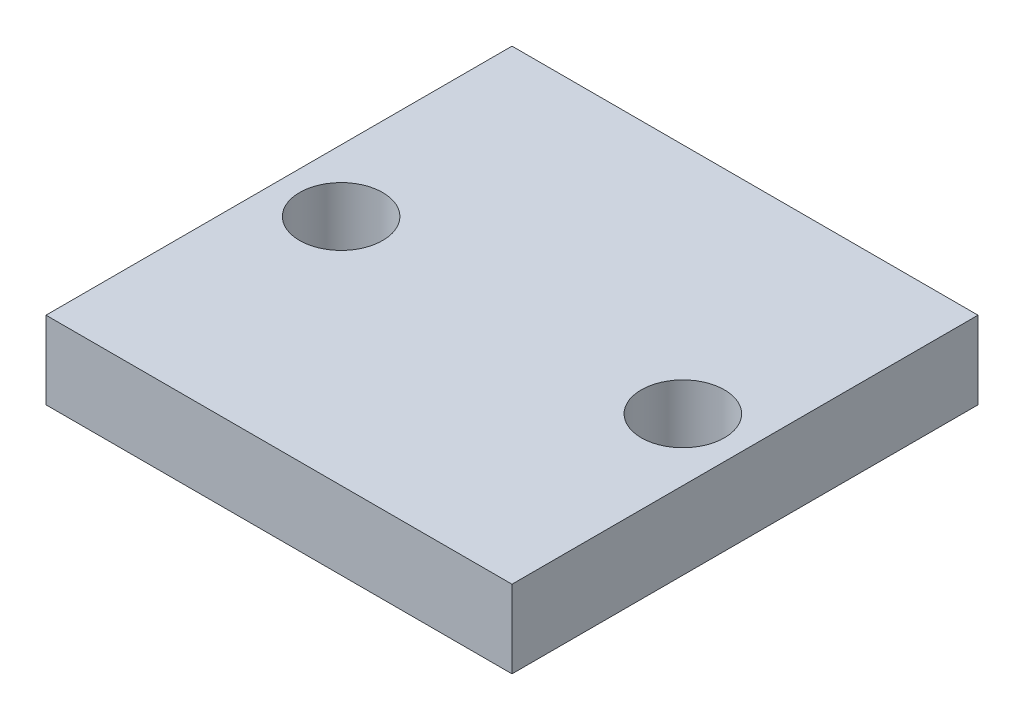
ISO-10303-21;
HEADER;
FILE_DESCRIPTION(('STEP AP214'),'2;1');
FILE_NAME('part.step','',(''),(''),'','','');
FILE_SCHEMA(('AUTOMOTIVE_DESIGN { 1 0 10303 214 1 1 1 1 }'));
ENDSEC;
DATA;
#1=APPLICATION_CONTEXT('core data for automotive mechanical design processes');
#2=APPLICATION_PROTOCOL_DEFINITION('international standard','automotive_design',2000,#1);
#3=PRODUCT_CONTEXT('',#1,'mechanical');
#4=PRODUCT('Part','Part','',(#3));
#5=PRODUCT_RELATED_PRODUCT_CATEGORY('part','',(#4));
#6=PRODUCT_DEFINITION_FORMATION('','',#4);
#7=PRODUCT_DEFINITION_CONTEXT('part definition',#1,'design');
#8=PRODUCT_DEFINITION('design','',#6,#7);
#9=PRODUCT_DEFINITION_SHAPE('','',#8);
#10=(LENGTH_UNIT() NAMED_UNIT(*) SI_UNIT(.MILLI.,.METRE.));
#11=(NAMED_UNIT(*) PLANE_ANGLE_UNIT() SI_UNIT($,.RADIAN.));
#12=(NAMED_UNIT(*) SI_UNIT($,.STERADIAN.) SOLID_ANGLE_UNIT());
#13=UNCERTAINTY_MEASURE_WITH_UNIT(LENGTH_MEASURE(1.E-05),#10,'distance_accuracy_value','');
#14=(GEOMETRIC_REPRESENTATION_CONTEXT(3) GLOBAL_UNCERTAINTY_ASSIGNED_CONTEXT((#13)) GLOBAL_UNIT_ASSIGNED_CONTEXT((#10,
#11,#12)) REPRESENTATION_CONTEXT('',''));
#15=CARTESIAN_POINT('',(0.,0.,0.));
#16=DIRECTION('',(0.,0.,1.));
#17=DIRECTION('',(1.,0.,0.));
#18=AXIS2_PLACEMENT_3D('',#15,#16,#17);
#19=CARTESIAN_POINT('',(-9.525,3.175,9.525));
#20=DIRECTION('',(1.,0.,0.));
#21=DIRECTION('',(0.,0.,-1.));
#22=AXIS2_PLACEMENT_3D('',#19,#20,#21);
#23=PLANE('',#22);
#24=DIRECTION('',(0.,0.,1.));
#25=VECTOR('',#24,1.);
#26=CARTESIAN_POINT('',(-9.525,0.,9.525));
#27=LINE('',#26,#25);
#28=CARTESIAN_POINT('',(-9.525,0.,-9.525));
#29=VERTEX_POINT('',#28);
#30=CARTESIAN_POINT('',(-9.525,0.,9.525));
#31=VERTEX_POINT('',#30);
#32=EDGE_CURVE('E95',#29,#31,#27,.T.);
#33=ORIENTED_EDGE('',*,*,#32,.T.);
#34=DIRECTION('',(0.,-1.,0.));
#35=VECTOR('',#34,1.);
#36=CARTESIAN_POINT('',(-9.525,3.175,9.525));
#37=LINE('',#36,#35);
#38=CARTESIAN_POINT('',(-9.525,3.175,9.525));
#39=VERTEX_POINT('',#38);
#40=EDGE_CURVE('E11',#39,#31,#37,.T.);
#41=ORIENTED_EDGE('',*,*,#40,.F.);
#42=DIRECTION('',(0.,0.,1.));
#43=VECTOR('',#42,1.);
#44=CARTESIAN_POINT('',(-9.525,3.175,9.525));
#45=LINE('',#44,#43);
#46=CARTESIAN_POINT('',(-9.525,3.175,-9.525));
#47=VERTEX_POINT('',#46);
#48=EDGE_CURVE('E83',#47,#39,#45,.T.);
#49=ORIENTED_EDGE('',*,*,#48,.F.);
#50=DIRECTION('',(0.,-1.,0.));
#51=VECTOR('',#50,1.);
#52=CARTESIAN_POINT('',(-9.525,3.175,-9.525));
#53=LINE('',#52,#51);
#54=EDGE_CURVE('E91',#47,#29,#53,.T.);
#55=ORIENTED_EDGE('',*,*,#54,.T.);
#56=EDGE_LOOP('',(#33,#41,#49,#55));
#57=FACE_BOUND('',#56,.T.);
#58=ADVANCED_FACE('F32',(#57),#23,.F.);
#59=CARTESIAN_POINT('',(9.525,3.175,9.525));
#60=DIRECTION('',(0.,0.,-1.));
#61=DIRECTION('',(-1.,0.,0.));
#62=AXIS2_PLACEMENT_3D('',#59,#60,#61);
#63=PLANE('',#62);
#64=DIRECTION('',(1.,0.,0.));
#65=VECTOR('',#64,1.);
#66=CARTESIAN_POINT('',(9.525,0.,9.525));
#67=LINE('',#66,#65);
#68=CARTESIAN_POINT('',(9.525,0.,9.525));
#69=VERTEX_POINT('',#68);
#70=EDGE_CURVE('E87',#31,#69,#67,.T.);
#71=ORIENTED_EDGE('',*,*,#70,.T.);
#72=DIRECTION('',(0.,-1.,0.));
#73=VECTOR('',#72,1.);
#74=CARTESIAN_POINT('',(9.525,3.175,9.525));
#75=LINE('',#74,#73);
#76=CARTESIAN_POINT('',(9.525,3.175,9.525));
#77=VERTEX_POINT('',#76);
#78=EDGE_CURVE('E40',#77,#69,#75,.T.);
#79=ORIENTED_EDGE('',*,*,#78,.F.);
#80=DIRECTION('',(1.,0.,0.));
#81=VECTOR('',#80,1.);
#82=CARTESIAN_POINT('',(9.525,3.175,9.525));
#83=LINE('',#82,#81);
#84=EDGE_CURVE('E78',#39,#77,#83,.T.);
#85=ORIENTED_EDGE('',*,*,#84,.F.);
#86=ORIENTED_EDGE('',*,*,#40,.T.);
#87=EDGE_LOOP('',(#71,#79,#85,#86));
#88=FACE_BOUND('',#87,.T.);
#89=ADVANCED_FACE('F86',(#88),#63,.F.);
#90=CARTESIAN_POINT('',(9.525,3.175,9.525));
#91=DIRECTION('',(-1.,0.,0.));
#92=DIRECTION('',(0.,0.,1.));
#93=AXIS2_PLACEMENT_3D('',#90,#91,#92);
#94=PLANE('',#93);
#95=DIRECTION('',(0.,0.,-1.));
#96=VECTOR('',#95,1.);
#97=CARTESIAN_POINT('',(9.525,0.,9.525));
#98=LINE('',#97,#96);
#99=CARTESIAN_POINT('',(9.525,0.,-9.525));
#100=VERTEX_POINT('',#99);
#101=EDGE_CURVE('E65',#69,#100,#98,.T.);
#102=ORIENTED_EDGE('',*,*,#101,.T.);
#103=DIRECTION('',(0.,-1.,0.));
#104=VECTOR('',#103,1.);
#105=CARTESIAN_POINT('',(9.525,3.175,-9.525));
#106=LINE('',#105,#104);
#107=CARTESIAN_POINT('',(9.525,3.175,-9.525));
#108=VERTEX_POINT('',#107);
#109=EDGE_CURVE('E88',#108,#100,#106,.T.);
#110=ORIENTED_EDGE('',*,*,#109,.F.);
#111=DIRECTION('',(0.,0.,-1.));
#112=VECTOR('',#111,1.);
#113=CARTESIAN_POINT('',(9.525,3.175,9.525));
#114=LINE('',#113,#112);
#115=EDGE_CURVE('E81',#77,#108,#114,.T.);
#116=ORIENTED_EDGE('',*,*,#115,.F.);
#117=ORIENTED_EDGE('',*,*,#78,.T.);
#118=EDGE_LOOP('',(#102,#110,#116,#117));
#119=FACE_BOUND('',#118,.T.);
#120=ADVANCED_FACE('F89',(#119),#94,.F.);
#121=CARTESIAN_POINT('',(9.525,3.175,-9.525));
#122=DIRECTION('',(0.,0.,1.));
#123=DIRECTION('',(1.,0.,0.));
#124=AXIS2_PLACEMENT_3D('',#121,#122,#123);
#125=PLANE('',#124);
#126=DIRECTION('',(-1.,0.,0.));
#127=VECTOR('',#126,1.);
#128=CARTESIAN_POINT('',(9.525,0.,-9.525));
#129=LINE('',#128,#127);
#130=EDGE_CURVE('E71',#100,#29,#129,.T.);
#131=ORIENTED_EDGE('',*,*,#130,.T.);
#132=ORIENTED_EDGE('',*,*,#54,.F.);
#133=DIRECTION('',(-1.,0.,0.));
#134=VECTOR('',#133,1.);
#135=CARTESIAN_POINT('',(9.525,3.175,-9.525));
#136=LINE('',#135,#134);
#137=EDGE_CURVE('E48',#108,#47,#136,.T.);
#138=ORIENTED_EDGE('',*,*,#137,.F.);
#139=ORIENTED_EDGE('',*,*,#109,.T.);
#140=EDGE_LOOP('',(#131,#132,#138,#139));
#141=FACE_BOUND('',#140,.T.);
#142=ADVANCED_FACE('F103',(#141),#125,.F.);
#143=CARTESIAN_POINT('',(0.,3.175,0.));
#144=DIRECTION('',(0.,1.,0.));
#145=DIRECTION('',(0.,0.,1.));
#146=AXIS2_PLACEMENT_3D('',#143,#144,#145);
#147=PLANE('',#146);
#148=CARTESIAN_POINT('',(6.98500000000001,3.175,0.));
#149=DIRECTION('',(0.,1.,0.));
#150=DIRECTION('',(0.,0.,1.));
#151=AXIS2_PLACEMENT_3D('',#148,#149,#150);
#152=CIRCLE('',#151,1.7);
#153=CARTESIAN_POINT('',(6.98500000000001,3.175,1.7));
#154=VERTEX_POINT('',#153);
#155=EDGE_CURVE('E117',#154,#154,#152,.T.);
#156=ORIENTED_EDGE('',*,*,#155,.F.);
#157=EDGE_LOOP('',(#156));
#158=FACE_BOUND('',#157,.T.);
#159=CARTESIAN_POINT('',(-6.98499999999999,3.175,0.));
#160=DIRECTION('',(0.,1.,0.));
#161=DIRECTION('',(0.,0.,1.));
#162=AXIS2_PLACEMENT_3D('',#159,#160,#161);
#163=CIRCLE('',#162,1.7);
#164=CARTESIAN_POINT('',(-6.98499999999999,3.175,1.7));
#165=VERTEX_POINT('',#164);
#166=EDGE_CURVE('E111',#165,#165,#163,.T.);
#167=ORIENTED_EDGE('',*,*,#166,.F.);
#168=EDGE_LOOP('',(#167));
#169=FACE_BOUND('',#168,.T.);
#170=ORIENTED_EDGE('',*,*,#48,.T.);
#171=ORIENTED_EDGE('',*,*,#84,.T.);
#172=ORIENTED_EDGE('',*,*,#115,.T.);
#173=ORIENTED_EDGE('',*,*,#137,.T.);
#174=EDGE_LOOP('',(#170,#171,#172,#173));
#175=FACE_BOUND('',#174,.T.);
#176=ADVANCED_FACE('F79',(#158,#169,#175),#147,.T.);
#177=CARTESIAN_POINT('',(0.,0.,0.));
#178=DIRECTION('',(0.,1.,0.));
#179=DIRECTION('',(0.,0.,1.));
#180=AXIS2_PLACEMENT_3D('',#177,#178,#179);
#181=PLANE('',#180);
#182=CARTESIAN_POINT('',(6.98500000000001,0.,0.));
#183=DIRECTION('',(0.,1.,0.));
#184=DIRECTION('',(0.,0.,1.));
#185=AXIS2_PLACEMENT_3D('',#182,#183,#184);
#186=CIRCLE('',#185,1.7);
#187=CARTESIAN_POINT('',(6.98500000000001,0.,1.69999999999999));
#188=VERTEX_POINT('',#187);
#189=EDGE_CURVE('E114',#188,#188,#186,.T.);
#190=ORIENTED_EDGE('',*,*,#189,.T.);
#191=EDGE_LOOP('',(#190));
#192=FACE_BOUND('',#191,.T.);
#193=CARTESIAN_POINT('',(-6.98499999999999,0.,0.));
#194=DIRECTION('',(0.,1.,0.));
#195=DIRECTION('',(0.,0.,1.));
#196=AXIS2_PLACEMENT_3D('',#193,#194,#195);
#197=CIRCLE('',#196,1.7);
#198=CARTESIAN_POINT('',(-6.98499999999999,0.,1.69999999999999));
#199=VERTEX_POINT('',#198);
#200=EDGE_CURVE('E98',#199,#199,#197,.T.);
#201=ORIENTED_EDGE('',*,*,#200,.T.);
#202=EDGE_LOOP('',(#201));
#203=FACE_BOUND('',#202,.T.);
#204=ORIENTED_EDGE('',*,*,#32,.F.);
#205=ORIENTED_EDGE('',*,*,#130,.F.);
#206=ORIENTED_EDGE('',*,*,#101,.F.);
#207=ORIENTED_EDGE('',*,*,#70,.F.);
#208=EDGE_LOOP('',(#204,#205,#206,#207));
#209=FACE_BOUND('',#208,.T.);
#210=ADVANCED_FACE('F106',(#192,#203,#209),#181,.F.);
#211=CARTESIAN_POINT('',(-6.98499999999999,3.175,0.));
#212=DIRECTION('',(0.,1.,0.));
#213=DIRECTION('',(0.,0.,1.));
#214=AXIS2_PLACEMENT_3D('',#211,#212,#213);
#215=CYLINDRICAL_SURFACE('',#214,1.7);
#216=ORIENTED_EDGE('',*,*,#166,.T.);
#217=EDGE_LOOP('',(#216));
#218=FACE_BOUND('',#217,.T.);
#219=ORIENTED_EDGE('',*,*,#200,.F.);
#220=EDGE_LOOP('',(#219));
#221=FACE_BOUND('',#220,.T.);
#222=ADVANCED_FACE('F129',(#218,#221),#215,.F.);
#223=CARTESIAN_POINT('',(6.98500000000001,3.175,0.));
#224=DIRECTION('',(0.,1.,0.));
#225=DIRECTION('',(0.,0.,1.));
#226=AXIS2_PLACEMENT_3D('',#223,#224,#225);
#227=CYLINDRICAL_SURFACE('',#226,1.7);
#228=ORIENTED_EDGE('',*,*,#155,.T.);
#229=EDGE_LOOP('',(#228));
#230=FACE_BOUND('',#229,.T.);
#231=ORIENTED_EDGE('',*,*,#189,.F.);
#232=EDGE_LOOP('',(#231));
#233=FACE_BOUND('',#232,.T.);
#234=ADVANCED_FACE('F121',(#230,#233),#227,.F.);
#235=CLOSED_SHELL('',(#58,#89,#120,#142,#176,#210,#222,#234));
#236=MANIFOLD_SOLID_BREP('B2',#235);
#237=ADVANCED_BREP_SHAPE_REPRESENTATION('',(#18,#236),#14);
#238=SHAPE_DEFINITION_REPRESENTATION(#9,#237);
ENDSEC;
END-ISO-10303-21;
